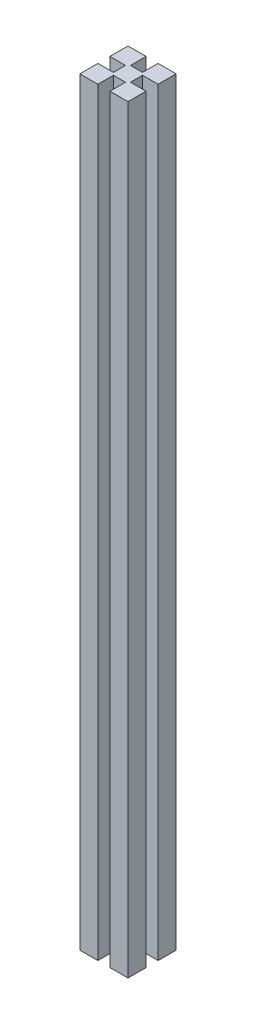
ISO-10303-21;
HEADER;
FILE_DESCRIPTION(('STEP AP214'),'2;1');
FILE_NAME('part.step','',(''),(''),'','','');
FILE_SCHEMA(('AUTOMOTIVE_DESIGN { 1 0 10303 214 1 1 1 1 }'));
ENDSEC;
DATA;
#1=APPLICATION_CONTEXT('core data for automotive mechanical design processes');
#2=APPLICATION_PROTOCOL_DEFINITION('international standard','automotive_design',2000,#1);
#3=PRODUCT_CONTEXT('',#1,'mechanical');
#4=PRODUCT('Part','Part','',(#3));
#5=PRODUCT_RELATED_PRODUCT_CATEGORY('part','',(#4));
#6=PRODUCT_DEFINITION_FORMATION('','',#4);
#7=PRODUCT_DEFINITION_CONTEXT('part definition',#1,'design');
#8=PRODUCT_DEFINITION('design','',#6,#7);
#9=PRODUCT_DEFINITION_SHAPE('','',#8);
#10=(LENGTH_UNIT() NAMED_UNIT(*) SI_UNIT(.MILLI.,.METRE.));
#11=(NAMED_UNIT(*) PLANE_ANGLE_UNIT() SI_UNIT($,.RADIAN.));
#12=(NAMED_UNIT(*) SI_UNIT($,.STERADIAN.) SOLID_ANGLE_UNIT());
#13=UNCERTAINTY_MEASURE_WITH_UNIT(LENGTH_MEASURE(1.E-05),#10,'distance_accuracy_value','');
#14=(GEOMETRIC_REPRESENTATION_CONTEXT(3) GLOBAL_UNCERTAINTY_ASSIGNED_CONTEXT((#13)) GLOBAL_UNIT_ASSIGNED_CONTEXT((#10,
#11,#12)) REPRESENTATION_CONTEXT('',''));
#15=CARTESIAN_POINT('',(0.,0.,0.));
#16=DIRECTION('',(0.,0.,1.));
#17=DIRECTION('',(1.,0.,0.));
#18=AXIS2_PLACEMENT_3D('',#15,#16,#17);
#19=CARTESIAN_POINT('',(-4.5,-95.2,30.13));
#20=DIRECTION('',(1.,0.,0.));
#21=DIRECTION('',(0.,0.,-1.));
#22=AXIS2_PLACEMENT_3D('',#19,#20,#21);
#23=PLANE('',#22);
#24=DIRECTION('',(0.,1.,0.));
#25=VECTOR('',#24,1.);
#26=CARTESIAN_POINT('',(-4.5,-95.2,30.13));
#27=LINE('',#26,#25);
#28=CARTESIAN_POINT('',(-4.5,292.1,30.13));
#29=VERTEX_POINT('',#28);
#30=CARTESIAN_POINT('',(-4.5,304.8,30.13));
#31=VERTEX_POINT('',#30);
#32=EDGE_CURVE('E316',#29,#31,#27,.T.);
#33=ORIENTED_EDGE('',*,*,#32,.F.);
#34=CARTESIAN_POINT('',(-4.5,292.1,33.305));
#35=DIRECTION('',(1.,0.,0.));
#36=DIRECTION('',(0.,0.,-1.));
#37=AXIS2_PLACEMENT_3D('',#34,#35,#36);
#38=CIRCLE('',#37,3.175);
#39=CARTESIAN_POINT('',(-4.5,292.1,36.48));
#40=VERTEX_POINT('',#39);
#41=EDGE_CURVE('E62',#29,#40,#38,.T.);
#42=ORIENTED_EDGE('',*,*,#41,.T.);
#43=DIRECTION('',(0.,1.,0.));
#44=VECTOR('',#43,1.);
#45=CARTESIAN_POINT('',(-4.5,-95.2,36.48));
#46=LINE('',#45,#44);
#47=CARTESIAN_POINT('',(-4.5,304.8,36.48));
#48=VERTEX_POINT('',#47);
#49=EDGE_CURVE('E310',#40,#48,#46,.T.);
#50=ORIENTED_EDGE('',*,*,#49,.T.);
#51=DIRECTION('',(0.,0.,-1.));
#52=VECTOR('',#51,1.);
#53=CARTESIAN_POINT('',(-4.5,304.8,30.13));
#54=LINE('',#53,#52);
#55=EDGE_CURVE('E317',#48,#31,#54,.T.);
#56=ORIENTED_EDGE('',*,*,#55,.T.);
#57=EDGE_LOOP('',(#33,#42,#50,#56));
#58=FACE_BOUND('',#57,.T.);
#59=ADVANCED_FACE('F45',(#58),#23,.F.);
#60=CARTESIAN_POINT('',(-4.5,266.7,36.48));
#61=VERTEX_POINT('',#60);
#62=EDGE_CURVE('E309',#61,#40,#46,.T.);
#63=ORIENTED_EDGE('',*,*,#62,.T.);
#64=EDGE_CURVE('E463',#40,#29,#38,.T.);
#65=ORIENTED_EDGE('',*,*,#64,.T.);
#66=CARTESIAN_POINT('',(-4.5,266.7,30.13));
#67=VERTEX_POINT('',#66);
#68=EDGE_CURVE('E315',#67,#29,#27,.T.);
#69=ORIENTED_EDGE('',*,*,#68,.F.);
#70=CARTESIAN_POINT('',(-4.5,266.7,33.305));
#71=DIRECTION('',(1.,0.,0.));
#72=DIRECTION('',(0.,0.,-1.));
#73=AXIS2_PLACEMENT_3D('',#70,#71,#72);
#74=CIRCLE('',#73,3.175);
#75=EDGE_CURVE('E69',#67,#61,#74,.T.);
#76=ORIENTED_EDGE('',*,*,#75,.T.);
#77=EDGE_LOOP('',(#63,#65,#69,#76));
#78=FACE_BOUND('',#77,.T.);
#79=ADVANCED_FACE('F477',(#78),#23,.F.);
#80=CARTESIAN_POINT('',(4.5,-95.2,30.13));
#81=DIRECTION('',(-1.,0.,0.));
#82=DIRECTION('',(0.,0.,1.));
#83=AXIS2_PLACEMENT_3D('',#80,#81,#82);
#84=PLANE('',#83);
#85=DIRECTION('',(0.,1.,0.));
#86=VECTOR('',#85,1.);
#87=CARTESIAN_POINT('',(4.5,-95.2,36.48));
#88=LINE('',#87,#86);
#89=CARTESIAN_POINT('',(4.5,292.1,36.48));
#90=VERTEX_POINT('',#89);
#91=CARTESIAN_POINT('',(4.5,304.8,36.48));
#92=VERTEX_POINT('',#91);
#93=EDGE_CURVE('E242',#90,#92,#88,.T.);
#94=ORIENTED_EDGE('',*,*,#93,.F.);
#95=CARTESIAN_POINT('',(4.5,292.1,33.305));
#96=DIRECTION('',(-1.,0.,0.));
#97=DIRECTION('',(0.,0.,1.));
#98=AXIS2_PLACEMENT_3D('',#95,#96,#97);
#99=CIRCLE('',#98,3.175);
#100=CARTESIAN_POINT('',(4.5,292.1,30.13));
#101=VERTEX_POINT('',#100);
#102=EDGE_CURVE('E466',#90,#101,#99,.T.);
#103=ORIENTED_EDGE('',*,*,#102,.T.);
#104=DIRECTION('',(0.,1.,0.));
#105=VECTOR('',#104,1.);
#106=CARTESIAN_POINT('',(4.5,-95.2,30.13));
#107=LINE('',#106,#105);
#108=CARTESIAN_POINT('',(4.5,304.8,30.13));
#109=VERTEX_POINT('',#108);
#110=EDGE_CURVE('E234',#101,#109,#107,.T.);
#111=ORIENTED_EDGE('',*,*,#110,.T.);
#112=DIRECTION('',(0.,0.,1.));
#113=VECTOR('',#112,1.);
#114=CARTESIAN_POINT('',(4.5,304.8,30.13));
#115=LINE('',#114,#113);
#116=EDGE_CURVE('E454',#109,#92,#115,.T.);
#117=ORIENTED_EDGE('',*,*,#116,.T.);
#118=EDGE_LOOP('',(#94,#103,#111,#117));
#119=FACE_BOUND('',#118,.T.);
#120=ADVANCED_FACE('F497',(#119),#84,.F.);
#121=CARTESIAN_POINT('',(4.5,266.7,30.13));
#122=VERTEX_POINT('',#121);
#123=EDGE_CURVE('E222',#122,#101,#107,.T.);
#124=ORIENTED_EDGE('',*,*,#123,.T.);
#125=EDGE_CURVE('E467',#101,#90,#99,.T.);
#126=ORIENTED_EDGE('',*,*,#125,.T.);
#127=CARTESIAN_POINT('',(4.5,266.7,36.48));
#128=VERTEX_POINT('',#127);
#129=EDGE_CURVE('E224',#128,#90,#88,.T.);
#130=ORIENTED_EDGE('',*,*,#129,.F.);
#131=CARTESIAN_POINT('',(4.5,266.7,33.305));
#132=DIRECTION('',(-1.,0.,0.));
#133=DIRECTION('',(0.,0.,1.));
#134=AXIS2_PLACEMENT_3D('',#131,#132,#133);
#135=CIRCLE('',#134,3.175);
#136=EDGE_CURVE('E211',#128,#122,#135,.T.);
#137=ORIENTED_EDGE('',*,*,#136,.T.);
#138=EDGE_LOOP('',(#124,#126,#130,#137));
#139=FACE_BOUND('',#138,.T.);
#140=ADVANCED_FACE('F220',(#139),#84,.F.);
#141=CARTESIAN_POINT('',(-12.7,-95.2,20.605));
#142=DIRECTION('',(-1.,0.,0.));
#143=DIRECTION('',(0.,0.,1.));
#144=AXIS2_PLACEMENT_3D('',#141,#142,#143);
#145=PLANE('',#144);
#146=DIRECTION('',(0.,1.,0.));
#147=VECTOR('',#146,1.);
#148=CARTESIAN_POINT('',(-12.7,-95.2,30.13));
#149=LINE('',#148,#147);
#150=CARTESIAN_POINT('',(-12.7,-95.2,30.13));
#151=VERTEX_POINT('',#150);
#152=CARTESIAN_POINT('',(-12.7,304.8,30.13));
#153=VERTEX_POINT('',#152);
#154=EDGE_CURVE('E298',#151,#153,#149,.T.);
#155=ORIENTED_EDGE('',*,*,#154,.T.);
#156=DIRECTION('',(0.,0.,1.));
#157=VECTOR('',#156,1.);
#158=CARTESIAN_POINT('',(-12.7,304.8,20.605));
#159=LINE('',#158,#157);
#160=CARTESIAN_POINT('',(-12.7,304.8,20.605));
#161=VERTEX_POINT('',#160);
#162=EDGE_CURVE('E395',#161,#153,#159,.T.);
#163=ORIENTED_EDGE('',*,*,#162,.F.);
#164=DIRECTION('',(0.,1.,0.));
#165=VECTOR('',#164,1.);
#166=CARTESIAN_POINT('',(-12.7,-95.2,20.605));
#167=LINE('',#166,#165);
#168=CARTESIAN_POINT('',(-12.7,-95.2,20.605));
#169=VERTEX_POINT('',#168);
#170=EDGE_CURVE('E11',#169,#161,#167,.T.);
#171=ORIENTED_EDGE('',*,*,#170,.F.);
#172=DIRECTION('',(0.,0.,1.));
#173=VECTOR('',#172,1.);
#174=CARTESIAN_POINT('',(-12.7,-95.2,20.605));
#175=LINE('',#174,#173);
#176=EDGE_CURVE('E375',#169,#151,#175,.T.);
#177=ORIENTED_EDGE('',*,*,#176,.T.);
#178=EDGE_LOOP('',(#155,#163,#171,#177));
#179=FACE_BOUND('',#178,.T.);
#180=ADVANCED_FACE('F585',(#179),#145,.T.);
#181=CARTESIAN_POINT('',(-12.7,-95.2,20.605));
#182=DIRECTION('',(0.,0.,-1.));
#183=DIRECTION('',(-1.,0.,0.));
#184=AXIS2_PLACEMENT_3D('',#181,#182,#183);
#185=PLANE('',#184);
#186=DIRECTION('',(0.,1.,0.));
#187=VECTOR('',#186,1.);
#188=CARTESIAN_POINT('',(-3.175,-95.2,20.605));
#189=LINE('',#188,#187);
#190=CARTESIAN_POINT('',(-3.175,-95.2,20.605));
#191=VERTEX_POINT('',#190);
#192=CARTESIAN_POINT('',(-3.175,304.8,20.605));
#193=VERTEX_POINT('',#192);
#194=EDGE_CURVE('E272',#191,#193,#189,.T.);
#195=ORIENTED_EDGE('',*,*,#194,.F.);
#196=DIRECTION('',(-1.,0.,0.));
#197=VECTOR('',#196,1.);
#198=CARTESIAN_POINT('',(-12.7,-95.2,20.605));
#199=LINE('',#198,#197);
#200=EDGE_CURVE('E390',#191,#169,#199,.T.);
#201=ORIENTED_EDGE('',*,*,#200,.T.);
#202=ORIENTED_EDGE('',*,*,#170,.T.);
#203=DIRECTION('',(-1.,0.,0.));
#204=VECTOR('',#203,1.);
#205=CARTESIAN_POINT('',(-12.7,304.8,20.605));
#206=LINE('',#205,#204);
#207=EDGE_CURVE('E410',#193,#161,#206,.T.);
#208=ORIENTED_EDGE('',*,*,#207,.F.);
#209=EDGE_LOOP('',(#195,#201,#202,#208));
#210=FACE_BOUND('',#209,.T.);
#211=ADVANCED_FACE('F580',(#210),#185,.T.);
#212=CARTESIAN_POINT('',(12.7,-95.2,20.605));
#213=DIRECTION('',(1.,0.,0.));
#214=DIRECTION('',(0.,0.,-1.));
#215=AXIS2_PLACEMENT_3D('',#212,#213,#214);
#216=PLANE('',#215);
#217=DIRECTION('',(0.,1.,0.));
#218=VECTOR('',#217,1.);
#219=CARTESIAN_POINT('',(12.7,-95.2,36.48));
#220=LINE('',#219,#218);
#221=CARTESIAN_POINT('',(12.7,-95.2,36.48));
#222=VERTEX_POINT('',#221);
#223=CARTESIAN_POINT('',(12.7,304.8,36.48));
#224=VERTEX_POINT('',#223);
#225=EDGE_CURVE('E443',#222,#224,#220,.T.);
#226=ORIENTED_EDGE('',*,*,#225,.T.);
#227=DIRECTION('',(0.,0.,-1.));
#228=VECTOR('',#227,1.);
#229=CARTESIAN_POINT('',(12.7,304.8,20.605));
#230=LINE('',#229,#228);
#231=CARTESIAN_POINT('',(12.7,304.8,46.005));
#232=VERTEX_POINT('',#231);
#233=EDGE_CURVE('E406',#232,#224,#230,.T.);
#234=ORIENTED_EDGE('',*,*,#233,.F.);
#235=DIRECTION('',(0.,1.,0.));
#236=VECTOR('',#235,1.);
#237=CARTESIAN_POINT('',(12.7,-95.2,46.005));
#238=LINE('',#237,#236);
#239=CARTESIAN_POINT('',(12.7,-95.2,46.005));
#240=VERTEX_POINT('',#239);
#241=EDGE_CURVE('E417',#240,#232,#238,.T.);
#242=ORIENTED_EDGE('',*,*,#241,.F.);
#243=DIRECTION('',(0.,0.,-1.));
#244=VECTOR('',#243,1.);
#245=CARTESIAN_POINT('',(12.7,-95.2,20.605));
#246=LINE('',#245,#244);
#247=EDGE_CURVE('E386',#240,#222,#246,.T.);
#248=ORIENTED_EDGE('',*,*,#247,.T.);
#249=EDGE_LOOP('',(#226,#234,#242,#248));
#250=FACE_BOUND('',#249,.T.);
#251=ADVANCED_FACE('F558',(#250),#216,.T.);
#252=CARTESIAN_POINT('',(-12.7,-95.2,46.005));
#253=DIRECTION('',(0.,0.,1.));
#254=DIRECTION('',(1.,0.,0.));
#255=AXIS2_PLACEMENT_3D('',#252,#253,#254);
#256=PLANE('',#255);
#257=DIRECTION('',(0.,1.,0.));
#258=VECTOR('',#257,1.);
#259=CARTESIAN_POINT('',(-3.17500000000001,-95.2,46.005));
#260=LINE('',#259,#258);
#261=CARTESIAN_POINT('',(-3.17500000000001,-95.2,46.005));
#262=VERTEX_POINT('',#261);
#263=CARTESIAN_POINT('',(-3.17500000000001,304.8,46.005));
#264=VERTEX_POINT('',#263);
#265=EDGE_CURVE('E339',#262,#264,#260,.T.);
#266=ORIENTED_EDGE('',*,*,#265,.T.);
#267=DIRECTION('',(1.,0.,0.));
#268=VECTOR('',#267,1.);
#269=CARTESIAN_POINT('',(-12.7,304.8,46.005));
#270=LINE('',#269,#268);
#271=CARTESIAN_POINT('',(-12.7,304.8,46.005));
#272=VERTEX_POINT('',#271);
#273=EDGE_CURVE('E401',#272,#264,#270,.T.);
#274=ORIENTED_EDGE('',*,*,#273,.F.);
#275=DIRECTION('',(0.,1.,0.));
#276=VECTOR('',#275,1.);
#277=CARTESIAN_POINT('',(-12.7,-95.2,46.005));
#278=LINE('',#277,#276);
#279=CARTESIAN_POINT('',(-12.7,-95.2,46.005));
#280=VERTEX_POINT('',#279);
#281=EDGE_CURVE('E49',#280,#272,#278,.T.);
#282=ORIENTED_EDGE('',*,*,#281,.F.);
#283=DIRECTION('',(1.,0.,0.));
#284=VECTOR('',#283,1.);
#285=CARTESIAN_POINT('',(-12.7,-95.2,46.005));
#286=LINE('',#285,#284);
#287=EDGE_CURVE('E381',#280,#262,#286,.T.);
#288=ORIENTED_EDGE('',*,*,#287,.T.);
#289=EDGE_LOOP('',(#266,#274,#282,#288));
#290=FACE_BOUND('',#289,.T.);
#291=ADVANCED_FACE('F434',(#290),#256,.T.);
#292=DIRECTION('',(0.,1.,0.));
#293=VECTOR('',#292,1.);
#294=CARTESIAN_POINT('',(-12.7,-95.2,36.48));
#295=LINE('',#294,#293);
#296=CARTESIAN_POINT('',(-12.7,-95.2,36.48));
#297=VERTEX_POINT('',#296);
#298=CARTESIAN_POINT('',(-12.7,304.8,36.48));
#299=VERTEX_POINT('',#298);
#300=EDGE_CURVE('E302',#297,#299,#295,.T.);
#301=ORIENTED_EDGE('',*,*,#300,.F.);
#302=EDGE_CURVE('E380',#297,#280,#175,.T.);
#303=ORIENTED_EDGE('',*,*,#302,.T.);
#304=ORIENTED_EDGE('',*,*,#281,.T.);
#305=EDGE_CURVE('E400',#299,#272,#159,.T.);
#306=ORIENTED_EDGE('',*,*,#305,.F.);
#307=EDGE_LOOP('',(#301,#303,#304,#306));
#308=FACE_BOUND('',#307,.T.);
#309=ADVANCED_FACE('F47',(#308),#145,.T.);
#310=DIRECTION('',(0.,1.,0.));
#311=VECTOR('',#310,1.);
#312=CARTESIAN_POINT('',(3.175,-95.2,20.605));
#313=LINE('',#312,#311);
#314=CARTESIAN_POINT('',(3.175,-95.2,20.605));
#315=VERTEX_POINT('',#314);
#316=CARTESIAN_POINT('',(3.175,304.8,20.605));
#317=VERTEX_POINT('',#316);
#318=EDGE_CURVE('E268',#315,#317,#313,.T.);
#319=ORIENTED_EDGE('',*,*,#318,.T.);
#320=CARTESIAN_POINT('',(12.7,304.8,20.605));
#321=VERTEX_POINT('',#320);
#322=EDGE_CURVE('E411',#321,#317,#206,.T.);
#323=ORIENTED_EDGE('',*,*,#322,.F.);
#324=DIRECTION('',(0.,1.,0.));
#325=VECTOR('',#324,1.);
#326=CARTESIAN_POINT('',(12.7,-95.2,20.605));
#327=LINE('',#326,#325);
#328=CARTESIAN_POINT('',(12.7,-95.2,20.605));
#329=VERTEX_POINT('',#328);
#330=EDGE_CURVE('E55',#329,#321,#327,.T.);
#331=ORIENTED_EDGE('',*,*,#330,.F.);
#332=EDGE_CURVE('E391',#329,#315,#199,.T.);
#333=ORIENTED_EDGE('',*,*,#332,.T.);
#334=EDGE_LOOP('',(#319,#323,#331,#333));
#335=FACE_BOUND('',#334,.T.);
#336=ADVANCED_FACE('F592',(#335),#185,.T.);
#337=DIRECTION('',(0.,1.,0.));
#338=VECTOR('',#337,1.);
#339=CARTESIAN_POINT('',(12.7,-95.2,30.13));
#340=LINE('',#339,#338);
#341=CARTESIAN_POINT('',(12.7,-95.2,30.13));
#342=VERTEX_POINT('',#341);
#343=CARTESIAN_POINT('',(12.7,304.8,30.13));
#344=VERTEX_POINT('',#343);
#345=EDGE_CURVE('E248',#342,#344,#340,.T.);
#346=ORIENTED_EDGE('',*,*,#345,.F.);
#347=EDGE_CURVE('E385',#342,#329,#246,.T.);
#348=ORIENTED_EDGE('',*,*,#347,.T.);
#349=ORIENTED_EDGE('',*,*,#330,.T.);
#350=EDGE_CURVE('E405',#344,#321,#230,.T.);
#351=ORIENTED_EDGE('',*,*,#350,.F.);
#352=EDGE_LOOP('',(#346,#348,#349,#351));
#353=FACE_BOUND('',#352,.T.);
#354=ADVANCED_FACE('F566',(#353),#216,.T.);
#355=DIRECTION('',(0.,1.,0.));
#356=VECTOR('',#355,1.);
#357=CARTESIAN_POINT('',(3.17499999999999,-95.2,46.005));
#358=LINE('',#357,#356);
#359=CARTESIAN_POINT('',(3.17499999999999,-95.2,46.005));
#360=VERTEX_POINT('',#359);
#361=CARTESIAN_POINT('',(3.17499999999999,304.8,46.005));
#362=VERTEX_POINT('',#361);
#363=EDGE_CURVE('E344',#360,#362,#358,.T.);
#364=ORIENTED_EDGE('',*,*,#363,.F.);
#365=EDGE_CURVE('E379',#360,#240,#286,.T.);
#366=ORIENTED_EDGE('',*,*,#365,.T.);
#367=ORIENTED_EDGE('',*,*,#241,.T.);
#368=EDGE_CURVE('E399',#362,#232,#270,.T.);
#369=ORIENTED_EDGE('',*,*,#368,.F.);
#370=EDGE_LOOP('',(#364,#366,#367,#369));
#371=FACE_BOUND('',#370,.T.);
#372=ADVANCED_FACE('F600',(#371),#256,.T.);
#373=CARTESIAN_POINT('',(0.,-95.2,0.));
#374=DIRECTION('',(0.,1.,0.));
#375=DIRECTION('',(0.,0.,1.));
#376=AXIS2_PLACEMENT_3D('',#373,#374,#375);
#377=PLANE('',#376);
#378=DIRECTION('',(0.,0.,1.));
#379=VECTOR('',#378,1.);
#380=CARTESIAN_POINT('',(4.5,-95.2,30.13));
#381=LINE('',#380,#379);
#382=CARTESIAN_POINT('',(4.5,-95.2,30.13));
#383=VERTEX_POINT('',#382);
#384=CARTESIAN_POINT('',(4.5,-95.2,36.48));
#385=VERTEX_POINT('',#384);
#386=EDGE_CURVE('E239',#383,#385,#381,.T.);
#387=ORIENTED_EDGE('',*,*,#386,.T.);
#388=DIRECTION('',(1.,0.,0.));
#389=VECTOR('',#388,1.);
#390=CARTESIAN_POINT('',(12.7,-95.2,36.48));
#391=LINE('',#390,#389);
#392=EDGE_CURVE('E253',#385,#222,#391,.T.);
#393=ORIENTED_EDGE('',*,*,#392,.T.);
#394=ORIENTED_EDGE('',*,*,#247,.F.);
#395=ORIENTED_EDGE('',*,*,#365,.F.);
#396=DIRECTION('',(0.,0.,-1.));
#397=VECTOR('',#396,1.);
#398=CARTESIAN_POINT('',(3.17499999999999,-95.2,46.005));
#399=LINE('',#398,#397);
#400=CARTESIAN_POINT('',(3.17499999999999,-95.2,37.805));
#401=VERTEX_POINT('',#400);
#402=EDGE_CURVE('E368',#360,#401,#399,.T.);
#403=ORIENTED_EDGE('',*,*,#402,.T.);
#404=DIRECTION('',(-1.,0.,0.));
#405=VECTOR('',#404,1.);
#406=CARTESIAN_POINT('',(-3.175,-95.2,37.805));
#407=LINE('',#406,#405);
#408=CARTESIAN_POINT('',(-3.175,-95.2,37.805));
#409=VERTEX_POINT('',#408);
#410=EDGE_CURVE('E343',#401,#409,#407,.T.);
#411=ORIENTED_EDGE('',*,*,#410,.T.);
#412=DIRECTION('',(0.,0.,1.));
#413=VECTOR('',#412,1.);
#414=CARTESIAN_POINT('',(-3.17500000000001,-95.2,46.005));
#415=LINE('',#414,#413);
#416=EDGE_CURVE('E358',#409,#262,#415,.T.);
#417=ORIENTED_EDGE('',*,*,#416,.T.);
#418=ORIENTED_EDGE('',*,*,#287,.F.);
#419=ORIENTED_EDGE('',*,*,#302,.F.);
#420=DIRECTION('',(1.,0.,0.));
#421=VECTOR('',#420,1.);
#422=CARTESIAN_POINT('',(-12.7,-95.2,36.48));
#423=LINE('',#422,#421);
#424=CARTESIAN_POINT('',(-4.5,-95.2,36.48));
#425=VERTEX_POINT('',#424);
#426=EDGE_CURVE('E332',#297,#425,#423,.T.);
#427=ORIENTED_EDGE('',*,*,#426,.T.);
#428=DIRECTION('',(0.,0.,-1.));
#429=VECTOR('',#428,1.);
#430=CARTESIAN_POINT('',(-4.5,-95.2,30.13));
#431=LINE('',#430,#429);
#432=CARTESIAN_POINT('',(-4.5,-95.2,30.13));
#433=VERTEX_POINT('',#432);
#434=EDGE_CURVE('E301',#425,#433,#431,.T.);
#435=ORIENTED_EDGE('',*,*,#434,.T.);
#436=DIRECTION('',(-1.,0.,0.));
#437=VECTOR('',#436,1.);
#438=CARTESIAN_POINT('',(-12.7,-95.2,30.13));
#439=LINE('',#438,#437);
#440=EDGE_CURVE('E322',#433,#151,#439,.T.);
#441=ORIENTED_EDGE('',*,*,#440,.T.);
#442=ORIENTED_EDGE('',*,*,#176,.F.);
#443=ORIENTED_EDGE('',*,*,#200,.F.);
#444=DIRECTION('',(0.,0.,1.));
#445=VECTOR('',#444,1.);
#446=CARTESIAN_POINT('',(-3.175,-95.2,20.605));
#447=LINE('',#446,#445);
#448=CARTESIAN_POINT('',(-3.175,-95.2,28.805));
#449=VERTEX_POINT('',#448);
#450=EDGE_CURVE('E280',#191,#449,#447,.T.);
#451=ORIENTED_EDGE('',*,*,#450,.T.);
#452=DIRECTION('',(1.,0.,0.));
#453=VECTOR('',#452,1.);
#454=CARTESIAN_POINT('',(-3.175,-95.2,28.805));
#455=LINE('',#454,#453);
#456=CARTESIAN_POINT('',(3.175,-95.2,28.805));
#457=VERTEX_POINT('',#456);
#458=EDGE_CURVE('E291',#449,#457,#455,.T.);
#459=ORIENTED_EDGE('',*,*,#458,.T.);
#460=DIRECTION('',(0.,0.,-1.));
#461=VECTOR('',#460,1.);
#462=CARTESIAN_POINT('',(3.175,-95.2,20.605));
#463=LINE('',#462,#461);
#464=EDGE_CURVE('E264',#457,#315,#463,.T.);
#465=ORIENTED_EDGE('',*,*,#464,.T.);
#466=ORIENTED_EDGE('',*,*,#332,.F.);
#467=ORIENTED_EDGE('',*,*,#347,.F.);
#468=DIRECTION('',(-1.,0.,0.));
#469=VECTOR('',#468,1.);
#470=CARTESIAN_POINT('',(12.7,-95.2,30.13));
#471=LINE('',#470,#469);
#472=EDGE_CURVE('E453',#342,#383,#471,.T.);
#473=ORIENTED_EDGE('',*,*,#472,.T.);
#474=EDGE_LOOP('',(#387,#393,#394,#395,#403,#411,#417,#418,#419,#427,#435,#441,#442,#443,#451,
#459,#465,#466,#467,#473));
#475=FACE_BOUND('',#474,.T.);
#476=ADVANCED_FACE('F487',(#475),#377,.F.);
#477=CARTESIAN_POINT('',(0.,304.8,0.));
#478=DIRECTION('',(0.,1.,0.));
#479=DIRECTION('',(0.,0.,1.));
#480=AXIS2_PLACEMENT_3D('',#477,#478,#479);
#481=PLANE('',#480);
#482=DIRECTION('',(1.,0.,0.));
#483=VECTOR('',#482,1.);
#484=CARTESIAN_POINT('',(12.7,304.8,36.48));
#485=LINE('',#484,#483);
#486=EDGE_CURVE('E450',#92,#224,#485,.T.);
#487=ORIENTED_EDGE('',*,*,#486,.F.);
#488=ORIENTED_EDGE('',*,*,#116,.F.);
#489=DIRECTION('',(-1.,0.,0.));
#490=VECTOR('',#489,1.);
#491=CARTESIAN_POINT('',(12.7,304.8,30.13));
#492=LINE('',#491,#490);
#493=EDGE_CURVE('E287',#344,#109,#492,.T.);
#494=ORIENTED_EDGE('',*,*,#493,.F.);
#495=ORIENTED_EDGE('',*,*,#350,.T.);
#496=ORIENTED_EDGE('',*,*,#322,.T.);
#497=DIRECTION('',(0.,0.,-1.));
#498=VECTOR('',#497,1.);
#499=CARTESIAN_POINT('',(3.175,304.8,20.605));
#500=LINE('',#499,#498);
#501=CARTESIAN_POINT('',(3.175,304.8,28.805));
#502=VERTEX_POINT('',#501);
#503=EDGE_CURVE('E276',#502,#317,#500,.T.);
#504=ORIENTED_EDGE('',*,*,#503,.F.);
#505=DIRECTION('',(1.,0.,0.));
#506=VECTOR('',#505,1.);
#507=CARTESIAN_POINT('',(-3.175,304.8,28.805));
#508=LINE('',#507,#506);
#509=CARTESIAN_POINT('',(-3.175,304.8,28.805));
#510=VERTEX_POINT('',#509);
#511=EDGE_CURVE('E279',#510,#502,#508,.T.);
#512=ORIENTED_EDGE('',*,*,#511,.F.);
#513=DIRECTION('',(0.,0.,1.));
#514=VECTOR('',#513,1.);
#515=CARTESIAN_POINT('',(-3.175,304.8,20.605));
#516=LINE('',#515,#514);
#517=EDGE_CURVE('E284',#193,#510,#516,.T.);
#518=ORIENTED_EDGE('',*,*,#517,.F.);
#519=ORIENTED_EDGE('',*,*,#207,.T.);
#520=ORIENTED_EDGE('',*,*,#162,.T.);
#521=DIRECTION('',(-1.,0.,0.));
#522=VECTOR('',#521,1.);
#523=CARTESIAN_POINT('',(-12.7,304.8,30.13));
#524=LINE('',#523,#522);
#525=EDGE_CURVE('E275',#31,#153,#524,.T.);
#526=ORIENTED_EDGE('',*,*,#525,.F.);
#527=ORIENTED_EDGE('',*,*,#55,.F.);
#528=DIRECTION('',(1.,0.,0.));
#529=VECTOR('',#528,1.);
#530=CARTESIAN_POINT('',(-12.7,304.8,36.48));
#531=LINE('',#530,#529);
#532=EDGE_CURVE('E321',#299,#48,#531,.T.);
#533=ORIENTED_EDGE('',*,*,#532,.F.);
#534=ORIENTED_EDGE('',*,*,#305,.T.);
#535=ORIENTED_EDGE('',*,*,#273,.T.);
#536=DIRECTION('',(0.,0.,1.));
#537=VECTOR('',#536,1.);
#538=CARTESIAN_POINT('',(-3.17500000000001,304.8,46.005));
#539=LINE('',#538,#537);
#540=CARTESIAN_POINT('',(-3.175,304.8,37.805));
#541=VERTEX_POINT('',#540);
#542=EDGE_CURVE('E362',#541,#264,#539,.T.);
#543=ORIENTED_EDGE('',*,*,#542,.F.);
#544=DIRECTION('',(-1.,0.,0.));
#545=VECTOR('',#544,1.);
#546=CARTESIAN_POINT('',(-3.175,304.8,37.805));
#547=LINE('',#546,#545);
#548=CARTESIAN_POINT('',(3.17499999999999,304.8,37.805));
#549=VERTEX_POINT('',#548);
#550=EDGE_CURVE('E353',#549,#541,#547,.T.);
#551=ORIENTED_EDGE('',*,*,#550,.F.);
#552=DIRECTION('',(0.,0.,-1.));
#553=VECTOR('',#552,1.);
#554=CARTESIAN_POINT('',(3.17499999999999,304.8,46.005));
#555=LINE('',#554,#553);
#556=EDGE_CURVE('E357',#362,#549,#555,.T.);
#557=ORIENTED_EDGE('',*,*,#556,.F.);
#558=ORIENTED_EDGE('',*,*,#368,.T.);
#559=ORIENTED_EDGE('',*,*,#233,.T.);
#560=EDGE_LOOP('',(#487,#488,#494,#495,#496,#504,#512,#518,#519,#520,#526,#527,#533,#534,#535,
#543,#551,#557,#558,#559));
#561=FACE_BOUND('',#560,.T.);
#562=ADVANCED_FACE('F438',(#561),#481,.T.);
#563=CARTESIAN_POINT('',(-3.17500000000001,-95.2,46.005));
#564=DIRECTION('',(-1.,0.,0.));
#565=DIRECTION('',(0.,0.,1.));
#566=AXIS2_PLACEMENT_3D('',#563,#564,#565);
#567=PLANE('',#566);
#568=ORIENTED_EDGE('',*,*,#542,.T.);
#569=ORIENTED_EDGE('',*,*,#265,.F.);
#570=ORIENTED_EDGE('',*,*,#416,.F.);
#571=DIRECTION('',(0.,1.,0.));
#572=VECTOR('',#571,1.);
#573=CARTESIAN_POINT('',(-3.175,-95.2,37.805));
#574=LINE('',#573,#572);
#575=EDGE_CURVE('E350',#409,#541,#574,.T.);
#576=ORIENTED_EDGE('',*,*,#575,.T.);
#577=EDGE_LOOP('',(#568,#569,#570,#576));
#578=FACE_BOUND('',#577,.T.);
#579=ADVANCED_FACE('F743',(#578),#567,.F.);
#580=CARTESIAN_POINT('',(-3.175,-95.2,37.805));
#581=DIRECTION('',(0.,0.,-1.));
#582=DIRECTION('',(-1.,0.,0.));
#583=AXIS2_PLACEMENT_3D('',#580,#581,#582);
#584=PLANE('',#583);
#585=ORIENTED_EDGE('',*,*,#550,.T.);
#586=ORIENTED_EDGE('',*,*,#575,.F.);
#587=ORIENTED_EDGE('',*,*,#410,.F.);
#588=DIRECTION('',(0.,1.,0.));
#589=VECTOR('',#588,1.);
#590=CARTESIAN_POINT('',(3.17499999999999,-95.2,37.805));
#591=LINE('',#590,#589);
#592=EDGE_CURVE('E347',#401,#549,#591,.T.);
#593=ORIENTED_EDGE('',*,*,#592,.T.);
#594=EDGE_LOOP('',(#585,#586,#587,#593));
#595=FACE_BOUND('',#594,.T.);
#596=ADVANCED_FACE('F530',(#595),#584,.F.);
#597=CARTESIAN_POINT('',(3.17499999999999,-95.2,46.005));
#598=DIRECTION('',(1.,0.,0.));
#599=DIRECTION('',(0.,0.,-1.));
#600=AXIS2_PLACEMENT_3D('',#597,#598,#599);
#601=PLANE('',#600);
#602=ORIENTED_EDGE('',*,*,#556,.T.);
#603=ORIENTED_EDGE('',*,*,#592,.F.);
#604=ORIENTED_EDGE('',*,*,#402,.F.);
#605=ORIENTED_EDGE('',*,*,#363,.T.);
#606=EDGE_LOOP('',(#602,#603,#604,#605));
#607=FACE_BOUND('',#606,.T.);
#608=ADVANCED_FACE('F523',(#607),#601,.F.);
#609=CARTESIAN_POINT('',(-12.7,-95.2,30.13));
#610=DIRECTION('',(0.,0.,-1.));
#611=DIRECTION('',(-1.,0.,0.));
#612=AXIS2_PLACEMENT_3D('',#609,#610,#611);
#613=PLANE('',#612);
#614=EDGE_CURVE('E311',#433,#67,#27,.T.);
#615=ORIENTED_EDGE('',*,*,#614,.T.);
#616=ORIENTED_EDGE('',*,*,#68,.T.);
#617=ORIENTED_EDGE('',*,*,#32,.T.);
#618=ORIENTED_EDGE('',*,*,#525,.T.);
#619=ORIENTED_EDGE('',*,*,#154,.F.);
#620=ORIENTED_EDGE('',*,*,#440,.F.);
#621=EDGE_LOOP('',(#615,#616,#617,#618,#619,#620));
#622=FACE_BOUND('',#621,.T.);
#623=ADVANCED_FACE('F516',(#622),#613,.F.);
#624=EDGE_CURVE('E305',#425,#61,#46,.T.);
#625=ORIENTED_EDGE('',*,*,#624,.T.);
#626=EDGE_CURVE('E227',#61,#67,#74,.T.);
#627=ORIENTED_EDGE('',*,*,#626,.T.);
#628=ORIENTED_EDGE('',*,*,#614,.F.);
#629=ORIENTED_EDGE('',*,*,#434,.F.);
#630=EDGE_LOOP('',(#625,#627,#628,#629));
#631=FACE_BOUND('',#630,.T.);
#632=ADVANCED_FACE('F484',(#631),#23,.F.);
#633=CARTESIAN_POINT('',(-12.7,-95.2,36.48));
#634=DIRECTION('',(0.,0.,1.));
#635=DIRECTION('',(1.,0.,0.));
#636=AXIS2_PLACEMENT_3D('',#633,#634,#635);
#637=PLANE('',#636);
#638=ORIENTED_EDGE('',*,*,#49,.F.);
#639=ORIENTED_EDGE('',*,*,#62,.F.);
#640=ORIENTED_EDGE('',*,*,#624,.F.);
#641=ORIENTED_EDGE('',*,*,#426,.F.);
#642=ORIENTED_EDGE('',*,*,#300,.T.);
#643=ORIENTED_EDGE('',*,*,#532,.T.);
#644=EDGE_LOOP('',(#638,#639,#640,#641,#642,#643));
#645=FACE_BOUND('',#644,.T.);
#646=ADVANCED_FACE('F481',(#645),#637,.F.);
#647=CARTESIAN_POINT('',(-3.175,-95.2,20.605));
#648=DIRECTION('',(-1.,0.,0.));
#649=DIRECTION('',(0.,0.,1.));
#650=AXIS2_PLACEMENT_3D('',#647,#648,#649);
#651=PLANE('',#650);
#652=ORIENTED_EDGE('',*,*,#517,.T.);
#653=DIRECTION('',(0.,1.,0.));
#654=VECTOR('',#653,1.);
#655=CARTESIAN_POINT('',(-3.175,-95.2,28.805));
#656=LINE('',#655,#654);
#657=EDGE_CURVE('E260',#449,#510,#656,.T.);
#658=ORIENTED_EDGE('',*,*,#657,.F.);
#659=ORIENTED_EDGE('',*,*,#450,.F.);
#660=ORIENTED_EDGE('',*,*,#194,.T.);
#661=EDGE_LOOP('',(#652,#658,#659,#660));
#662=FACE_BOUND('',#661,.T.);
#663=ADVANCED_FACE('F522',(#662),#651,.F.);
#664=CARTESIAN_POINT('',(3.175,-95.2,20.605));
#665=DIRECTION('',(1.,0.,0.));
#666=DIRECTION('',(0.,0.,-1.));
#667=AXIS2_PLACEMENT_3D('',#664,#665,#666);
#668=PLANE('',#667);
#669=ORIENTED_EDGE('',*,*,#503,.T.);
#670=ORIENTED_EDGE('',*,*,#318,.F.);
#671=ORIENTED_EDGE('',*,*,#464,.F.);
#672=DIRECTION('',(0.,1.,0.));
#673=VECTOR('',#672,1.);
#674=CARTESIAN_POINT('',(3.175,-95.2,28.805));
#675=LINE('',#674,#673);
#676=EDGE_CURVE('E265',#457,#502,#675,.T.);
#677=ORIENTED_EDGE('',*,*,#676,.T.);
#678=EDGE_LOOP('',(#669,#670,#671,#677));
#679=FACE_BOUND('',#678,.T.);
#680=ADVANCED_FACE('F534',(#679),#668,.F.);
#681=CARTESIAN_POINT('',(-3.175,-95.2,28.805));
#682=DIRECTION('',(0.,0.,1.));
#683=DIRECTION('',(1.,0.,0.));
#684=AXIS2_PLACEMENT_3D('',#681,#682,#683);
#685=PLANE('',#684);
#686=ORIENTED_EDGE('',*,*,#511,.T.);
#687=ORIENTED_EDGE('',*,*,#676,.F.);
#688=ORIENTED_EDGE('',*,*,#458,.F.);
#689=ORIENTED_EDGE('',*,*,#657,.T.);
#690=EDGE_LOOP('',(#686,#687,#688,#689));
#691=FACE_BOUND('',#690,.T.);
#692=ADVANCED_FACE('F537',(#691),#685,.F.);
#693=CARTESIAN_POINT('',(12.7,-95.2,36.48));
#694=DIRECTION('',(0.,0.,1.));
#695=DIRECTION('',(1.,0.,0.));
#696=AXIS2_PLACEMENT_3D('',#693,#694,#695);
#697=PLANE('',#696);
#698=ORIENTED_EDGE('',*,*,#486,.T.);
#699=ORIENTED_EDGE('',*,*,#225,.F.);
#700=ORIENTED_EDGE('',*,*,#392,.F.);
#701=EDGE_CURVE('E245',#385,#128,#88,.T.);
#702=ORIENTED_EDGE('',*,*,#701,.T.);
#703=ORIENTED_EDGE('',*,*,#129,.T.);
#704=ORIENTED_EDGE('',*,*,#93,.T.);
#705=EDGE_LOOP('',(#698,#699,#700,#702,#703,#704));
#706=FACE_BOUND('',#705,.T.);
#707=ADVANCED_FACE('F541',(#706),#697,.F.);
#708=EDGE_CURVE('E231',#383,#122,#107,.T.);
#709=ORIENTED_EDGE('',*,*,#708,.T.);
#710=EDGE_CURVE('E208',#122,#128,#135,.T.);
#711=ORIENTED_EDGE('',*,*,#710,.T.);
#712=ORIENTED_EDGE('',*,*,#701,.F.);
#713=ORIENTED_EDGE('',*,*,#386,.F.);
#714=EDGE_LOOP('',(#709,#711,#712,#713));
#715=FACE_BOUND('',#714,.T.);
#716=ADVANCED_FACE('F237',(#715),#84,.F.);
#717=CARTESIAN_POINT('',(12.7,-95.2,30.13));
#718=DIRECTION('',(0.,0.,-1.));
#719=DIRECTION('',(-1.,0.,0.));
#720=AXIS2_PLACEMENT_3D('',#717,#718,#719);
#721=PLANE('',#720);
#722=ORIENTED_EDGE('',*,*,#345,.T.);
#723=ORIENTED_EDGE('',*,*,#493,.T.);
#724=ORIENTED_EDGE('',*,*,#110,.F.);
#725=ORIENTED_EDGE('',*,*,#123,.F.);
#726=ORIENTED_EDGE('',*,*,#708,.F.);
#727=ORIENTED_EDGE('',*,*,#472,.F.);
#728=EDGE_LOOP('',(#722,#723,#724,#725,#726,#727));
#729=FACE_BOUND('',#728,.T.);
#730=ADVANCED_FACE('F230',(#729),#721,.F.);
#731=CARTESIAN_POINT('',(19.5338143213269,266.7,33.305));
#732=DIRECTION('',(-1.,0.,0.));
#733=DIRECTION('',(0.,0.,1.));
#734=AXIS2_PLACEMENT_3D('',#731,#732,#733);
#735=CYLINDRICAL_SURFACE('',#734,3.175);
#736=ORIENTED_EDGE('',*,*,#710,.F.);
#737=ORIENTED_EDGE('',*,*,#136,.F.);
#738=EDGE_LOOP('',(#736,#737));
#739=FACE_BOUND('',#738,.T.);
#740=ORIENTED_EDGE('',*,*,#626,.F.);
#741=ORIENTED_EDGE('',*,*,#75,.F.);
#742=EDGE_LOOP('',(#740,#741));
#743=FACE_BOUND('',#742,.T.);
#744=ADVANCED_FACE('F210',(#739,#743),#735,.F.);
#745=CARTESIAN_POINT('',(19.5338143213269,292.1,33.305));
#746=DIRECTION('',(-1.,0.,0.));
#747=DIRECTION('',(0.,0.,1.));
#748=AXIS2_PLACEMENT_3D('',#745,#746,#747);
#749=CYLINDRICAL_SURFACE('',#748,3.175);
#750=ORIENTED_EDGE('',*,*,#125,.F.);
#751=ORIENTED_EDGE('',*,*,#102,.F.);
#752=EDGE_LOOP('',(#750,#751));
#753=FACE_BOUND('',#752,.T.);
#754=ORIENTED_EDGE('',*,*,#64,.F.);
#755=ORIENTED_EDGE('',*,*,#41,.F.);
#756=EDGE_LOOP('',(#754,#755));
#757=FACE_BOUND('',#756,.T.);
#758=ADVANCED_FACE('F499',(#753,#757),#749,.F.);
#759=CLOSED_SHELL('',(#59,#79,#120,#140,#180,#211,#251,#291,#309,#336,#354,#372,#476,#562,#579,
#596,#608,#623,#632,#646,#663,#680,#692,#707,#716,#730,#744,#758));
#760=MANIFOLD_SOLID_BREP('B2',#759);
#761=ADVANCED_BREP_SHAPE_REPRESENTATION('',(#18,#760),#14);
#762=SHAPE_DEFINITION_REPRESENTATION(#9,#761);
ENDSEC;
END-ISO-10303-21;
